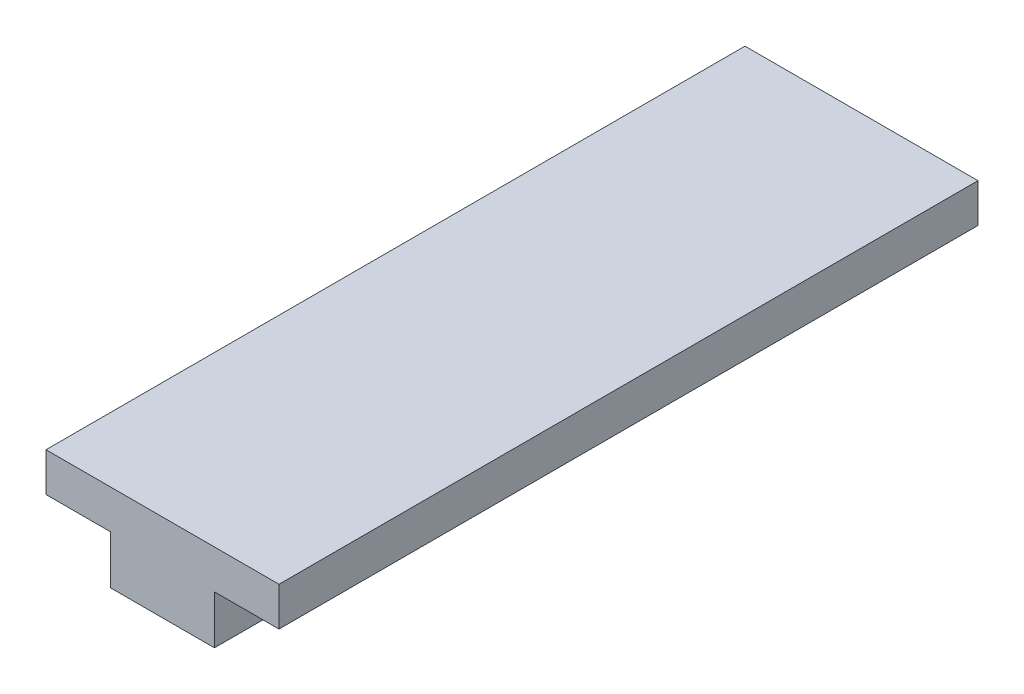
ISO-10303-21;
HEADER;
FILE_DESCRIPTION(('STEP AP214'),'2;1');
FILE_NAME('part.step','',(''),(''),'','','');
FILE_SCHEMA(('AUTOMOTIVE_DESIGN { 1 0 10303 214 1 1 1 1 }'));
ENDSEC;
DATA;
#1=APPLICATION_CONTEXT('core data for automotive mechanical design processes');
#2=APPLICATION_PROTOCOL_DEFINITION('international standard','automotive_design',2000,#1);
#3=PRODUCT_CONTEXT('',#1,'mechanical');
#4=PRODUCT('Part','Part','',(#3));
#5=PRODUCT_RELATED_PRODUCT_CATEGORY('part','',(#4));
#6=PRODUCT_DEFINITION_FORMATION('','',#4);
#7=PRODUCT_DEFINITION_CONTEXT('part definition',#1,'design');
#8=PRODUCT_DEFINITION('design','',#6,#7);
#9=PRODUCT_DEFINITION_SHAPE('','',#8);
#10=(LENGTH_UNIT() NAMED_UNIT(*) SI_UNIT(.MILLI.,.METRE.));
#11=(NAMED_UNIT(*) PLANE_ANGLE_UNIT() SI_UNIT($,.RADIAN.));
#12=(NAMED_UNIT(*) SI_UNIT($,.STERADIAN.) SOLID_ANGLE_UNIT());
#13=UNCERTAINTY_MEASURE_WITH_UNIT(LENGTH_MEASURE(1.E-05),#10,'distance_accuracy_value','');
#14=(GEOMETRIC_REPRESENTATION_CONTEXT(3) GLOBAL_UNCERTAINTY_ASSIGNED_CONTEXT((#13)) GLOBAL_UNIT_ASSIGNED_CONTEXT((#10,
#11,#12)) REPRESENTATION_CONTEXT('',''));
#15=CARTESIAN_POINT('',(0.,0.,0.));
#16=DIRECTION('',(0.,0.,1.));
#17=DIRECTION('',(1.,0.,0.));
#18=AXIS2_PLACEMENT_3D('',#15,#16,#17);
#19=CARTESIAN_POINT('',(12.,0.,0.));
#20=DIRECTION('',(0.,1.,0.));
#21=DIRECTION('',(0.,0.,1.));
#22=AXIS2_PLACEMENT_3D('',#19,#20,#21);
#23=PLANE('',#22);
#24=DIRECTION('',(0.,0.,-1.));
#25=VECTOR('',#24,1.);
#26=CARTESIAN_POINT('',(-5.35,0.,0.));
#27=LINE('',#26,#25);
#28=CARTESIAN_POINT('',(-5.35,0.,0.));
#29=VERTEX_POINT('',#28);
#30=CARTESIAN_POINT('',(-5.35000000000002,0.,-44.65));
#31=VERTEX_POINT('',#30);
#32=EDGE_CURVE('E132',#29,#31,#27,.T.);
#33=ORIENTED_EDGE('',*,*,#32,.F.);
#34=DIRECTION('',(-1.,0.,0.));
#35=VECTOR('',#34,1.);
#36=CARTESIAN_POINT('',(12.,0.,0.));
#37=LINE('',#36,#35);
#38=CARTESIAN_POINT('',(-12.,0.,0.));
#39=VERTEX_POINT('',#38);
#40=EDGE_CURVE('E88',#29,#39,#37,.T.);
#41=ORIENTED_EDGE('',*,*,#40,.T.);
#42=DIRECTION('',(0.,0.,-1.));
#43=VECTOR('',#42,1.);
#44=CARTESIAN_POINT('',(-12.,0.,0.));
#45=LINE('',#44,#43);
#46=CARTESIAN_POINT('',(-12.,0.,-72.));
#47=VERTEX_POINT('',#46);
#48=EDGE_CURVE('E157',#39,#47,#45,.T.);
#49=ORIENTED_EDGE('',*,*,#48,.T.);
#50=DIRECTION('',(-1.,0.,0.));
#51=VECTOR('',#50,1.);
#52=CARTESIAN_POINT('',(12.,0.,-72.));
#53=LINE('',#52,#51);
#54=CARTESIAN_POINT('',(12.,0.,-72.));
#55=VERTEX_POINT('',#54);
#56=EDGE_CURVE('E11',#55,#47,#53,.T.);
#57=ORIENTED_EDGE('',*,*,#56,.F.);
#58=DIRECTION('',(0.,0.,-1.));
#59=VECTOR('',#58,1.);
#60=CARTESIAN_POINT('',(12.,0.,0.));
#61=LINE('',#60,#59);
#62=CARTESIAN_POINT('',(12.,0.,0.));
#63=VERTEX_POINT('',#62);
#64=EDGE_CURVE('E163',#63,#55,#61,.T.);
#65=ORIENTED_EDGE('',*,*,#64,.F.);
#66=CARTESIAN_POINT('',(5.35,0.,0.));
#67=VERTEX_POINT('',#66);
#68=EDGE_CURVE('E65',#63,#67,#37,.T.);
#69=ORIENTED_EDGE('',*,*,#68,.T.);
#70=DIRECTION('',(0.,0.,-1.));
#71=VECTOR('',#70,1.);
#72=CARTESIAN_POINT('',(5.35,0.,0.));
#73=LINE('',#72,#71);
#74=CARTESIAN_POINT('',(5.35,0.,-44.65));
#75=VERTEX_POINT('',#74);
#76=EDGE_CURVE('E141',#67,#75,#73,.T.);
#77=ORIENTED_EDGE('',*,*,#76,.T.);
#78=CARTESIAN_POINT('',(0.,0.,-44.65));
#79=DIRECTION('',(0.,1.,0.));
#80=DIRECTION('',(0.,0.,1.));
#81=AXIS2_PLACEMENT_3D('',#78,#79,#80);
#82=CIRCLE('',#81,5.35000000000001);
#83=EDGE_CURVE('E56',#31,#75,#82,.F.);
#84=ORIENTED_EDGE('',*,*,#83,.F.);
#85=EDGE_LOOP('',(#33,#41,#49,#57,#65,#69,#77,#84));
#86=FACE_BOUND('',#85,.T.);
#87=ADVANCED_FACE('F41',(#86),#23,.F.);
#88=CARTESIAN_POINT('',(12.,0.,-72.));
#89=DIRECTION('',(0.,0.,1.));
#90=DIRECTION('',(1.,0.,0.));
#91=AXIS2_PLACEMENT_3D('',#88,#89,#90);
#92=PLANE('',#91);
#93=DIRECTION('',(0.,1.,0.));
#94=VECTOR('',#93,1.);
#95=CARTESIAN_POINT('',(-12.,0.,-72.));
#96=LINE('',#95,#94);
#97=CARTESIAN_POINT('',(-12.,3.99999999999999,-72.));
#98=VERTEX_POINT('',#97);
#99=EDGE_CURVE('E178',#47,#98,#96,.T.);
#100=ORIENTED_EDGE('',*,*,#99,.T.);
#101=DIRECTION('',(-1.,0.,0.));
#102=VECTOR('',#101,1.);
#103=CARTESIAN_POINT('',(12.,3.99999999999999,-72.));
#104=LINE('',#103,#102);
#105=CARTESIAN_POINT('',(12.,3.99999999999999,-72.));
#106=VERTEX_POINT('',#105);
#107=EDGE_CURVE('E49',#106,#98,#104,.T.);
#108=ORIENTED_EDGE('',*,*,#107,.F.);
#109=DIRECTION('',(0.,1.,0.));
#110=VECTOR('',#109,1.);
#111=CARTESIAN_POINT('',(12.,0.,-72.));
#112=LINE('',#111,#110);
#113=EDGE_CURVE('E95',#55,#106,#112,.T.);
#114=ORIENTED_EDGE('',*,*,#113,.F.);
#115=ORIENTED_EDGE('',*,*,#56,.T.);
#116=EDGE_LOOP('',(#100,#108,#114,#115));
#117=FACE_BOUND('',#116,.T.);
#118=ADVANCED_FACE('F198',(#117),#92,.F.);
#119=CARTESIAN_POINT('',(12.,3.99999999999999,0.));
#120=DIRECTION('',(0.,1.,0.));
#121=DIRECTION('',(0.,0.,1.));
#122=AXIS2_PLACEMENT_3D('',#119,#120,#121);
#123=PLANE('',#122);
#124=DIRECTION('',(0.,0.,-1.));
#125=VECTOR('',#124,1.);
#126=CARTESIAN_POINT('',(-12.,3.99999999999999,0.));
#127=LINE('',#126,#125);
#128=CARTESIAN_POINT('',(-12.,3.99999999999999,0.));
#129=VERTEX_POINT('',#128);
#130=EDGE_CURVE('E182',#129,#98,#127,.T.);
#131=ORIENTED_EDGE('',*,*,#130,.F.);
#132=DIRECTION('',(-1.,0.,0.));
#133=VECTOR('',#132,1.);
#134=CARTESIAN_POINT('',(12.,3.99999999999999,0.));
#135=LINE('',#134,#133);
#136=CARTESIAN_POINT('',(12.,3.99999999999999,0.));
#137=VERTEX_POINT('',#136);
#138=EDGE_CURVE('E191',#137,#129,#135,.T.);
#139=ORIENTED_EDGE('',*,*,#138,.F.);
#140=DIRECTION('',(0.,0.,-1.));
#141=VECTOR('',#140,1.);
#142=CARTESIAN_POINT('',(12.,3.99999999999999,0.));
#143=LINE('',#142,#141);
#144=EDGE_CURVE('E169',#137,#106,#143,.T.);
#145=ORIENTED_EDGE('',*,*,#144,.T.);
#146=ORIENTED_EDGE('',*,*,#107,.T.);
#147=EDGE_LOOP('',(#131,#139,#145,#146));
#148=FACE_BOUND('',#147,.T.);
#149=ADVANCED_FACE('F196',(#148),#123,.T.);
#150=CARTESIAN_POINT('',(12.,0.,0.));
#151=DIRECTION('',(0.,0.,1.));
#152=DIRECTION('',(1.,0.,0.));
#153=AXIS2_PLACEMENT_3D('',#150,#151,#152);
#154=PLANE('',#153);
#155=DIRECTION('',(0.,1.,0.));
#156=VECTOR('',#155,1.);
#157=CARTESIAN_POINT('',(-12.,0.,0.));
#158=LINE('',#157,#156);
#159=EDGE_CURVE('E166',#39,#129,#158,.T.);
#160=ORIENTED_EDGE('',*,*,#159,.F.);
#161=ORIENTED_EDGE('',*,*,#40,.F.);
#162=DIRECTION('',(0.,1.,0.));
#163=VECTOR('',#162,1.);
#164=CARTESIAN_POINT('',(-5.35,-5.,0.));
#165=LINE('',#164,#163);
#166=CARTESIAN_POINT('',(-5.35,-5.,0.));
#167=VERTEX_POINT('',#166);
#168=EDGE_CURVE('E134',#167,#29,#165,.T.);
#169=ORIENTED_EDGE('',*,*,#168,.F.);
#170=DIRECTION('',(1.,0.,0.));
#171=VECTOR('',#170,1.);
#172=CARTESIAN_POINT('',(0.,-5.,0.));
#173=LINE('',#172,#171);
#174=CARTESIAN_POINT('',(5.35,-5.,0.));
#175=VERTEX_POINT('',#174);
#176=EDGE_CURVE('E126',#167,#175,#173,.T.);
#177=ORIENTED_EDGE('',*,*,#176,.T.);
#178=DIRECTION('',(0.,1.,0.));
#179=VECTOR('',#178,1.);
#180=CARTESIAN_POINT('',(5.35,-5.,0.));
#181=LINE('',#180,#179);
#182=EDGE_CURVE('E158',#175,#67,#181,.T.);
#183=ORIENTED_EDGE('',*,*,#182,.T.);
#184=ORIENTED_EDGE('',*,*,#68,.F.);
#185=DIRECTION('',(0.,1.,0.));
#186=VECTOR('',#185,1.);
#187=CARTESIAN_POINT('',(12.,0.,0.));
#188=LINE('',#187,#186);
#189=EDGE_CURVE('E173',#63,#137,#188,.T.);
#190=ORIENTED_EDGE('',*,*,#189,.T.);
#191=ORIENTED_EDGE('',*,*,#138,.T.);
#192=EDGE_LOOP('',(#160,#161,#169,#177,#183,#184,#190,#191));
#193=FACE_BOUND('',#192,.T.);
#194=ADVANCED_FACE('F203',(#193),#154,.T.);
#195=CARTESIAN_POINT('',(12.,0.,0.));
#196=DIRECTION('',(1.,0.,0.));
#197=DIRECTION('',(0.,0.,-1.));
#198=AXIS2_PLACEMENT_3D('',#195,#196,#197);
#199=PLANE('',#198);
#200=ORIENTED_EDGE('',*,*,#64,.T.);
#201=ORIENTED_EDGE('',*,*,#113,.T.);
#202=ORIENTED_EDGE('',*,*,#144,.F.);
#203=ORIENTED_EDGE('',*,*,#189,.F.);
#204=EDGE_LOOP('',(#200,#201,#202,#203));
#205=FACE_BOUND('',#204,.T.);
#206=ADVANCED_FACE('F206',(#205),#199,.T.);
#207=CARTESIAN_POINT('',(-12.,0.,0.));
#208=DIRECTION('',(1.,0.,0.));
#209=DIRECTION('',(0.,0.,-1.));
#210=AXIS2_PLACEMENT_3D('',#207,#208,#209);
#211=PLANE('',#210);
#212=ORIENTED_EDGE('',*,*,#48,.F.);
#213=ORIENTED_EDGE('',*,*,#159,.T.);
#214=ORIENTED_EDGE('',*,*,#130,.T.);
#215=ORIENTED_EDGE('',*,*,#99,.F.);
#216=EDGE_LOOP('',(#212,#213,#214,#215));
#217=FACE_BOUND('',#216,.T.);
#218=ADVANCED_FACE('F201',(#217),#211,.F.);
#219=CARTESIAN_POINT('',(0.,-5.,-44.65));
#220=DIRECTION('',(0.,1.,0.));
#221=DIRECTION('',(0.,0.,1.));
#222=AXIS2_PLACEMENT_3D('',#219,#220,#221);
#223=CYLINDRICAL_SURFACE('',#222,5.35000000000001);
#224=ORIENTED_EDGE('',*,*,#83,.T.);
#225=DIRECTION('',(0.,1.,0.));
#226=VECTOR('',#225,1.);
#227=CARTESIAN_POINT('',(5.35,-5.,-44.65));
#228=LINE('',#227,#226);
#229=CARTESIAN_POINT('',(5.35,-5.,-44.65));
#230=VERTEX_POINT('',#229);
#231=EDGE_CURVE('E138',#230,#75,#228,.T.);
#232=ORIENTED_EDGE('',*,*,#231,.F.);
#233=CARTESIAN_POINT('',(0.,-5.,-44.65));
#234=DIRECTION('',(0.,1.,0.));
#235=DIRECTION('',(0.,0.,1.));
#236=AXIS2_PLACEMENT_3D('',#233,#234,#235);
#237=CIRCLE('',#236,5.35000000000001);
#238=CARTESIAN_POINT('',(-5.35000000000002,-5.,-44.65));
#239=VERTEX_POINT('',#238);
#240=EDGE_CURVE('E124',#239,#230,#237,.F.);
#241=ORIENTED_EDGE('',*,*,#240,.F.);
#242=DIRECTION('',(0.,1.,0.));
#243=VECTOR('',#242,1.);
#244=CARTESIAN_POINT('',(-5.35000000000002,-5.,-44.65));
#245=LINE('',#244,#243);
#246=EDGE_CURVE('E130',#239,#31,#245,.T.);
#247=ORIENTED_EDGE('',*,*,#246,.T.);
#248=EDGE_LOOP('',(#224,#232,#241,#247));
#249=FACE_BOUND('',#248,.T.);
#250=ADVANCED_FACE('F137',(#249),#223,.T.);
#251=CARTESIAN_POINT('',(5.35,-5.,0.));
#252=DIRECTION('',(1.,0.,0.));
#253=DIRECTION('',(0.,0.,-1.));
#254=AXIS2_PLACEMENT_3D('',#251,#252,#253);
#255=PLANE('',#254);
#256=ORIENTED_EDGE('',*,*,#76,.F.);
#257=ORIENTED_EDGE('',*,*,#182,.F.);
#258=DIRECTION('',(0.,0.,-1.));
#259=VECTOR('',#258,1.);
#260=CARTESIAN_POINT('',(5.35,-5.,0.));
#261=LINE('',#260,#259);
#262=EDGE_CURVE('E135',#175,#230,#261,.T.);
#263=ORIENTED_EDGE('',*,*,#262,.T.);
#264=ORIENTED_EDGE('',*,*,#231,.T.);
#265=EDGE_LOOP('',(#256,#257,#263,#264));
#266=FACE_BOUND('',#265,.T.);
#267=ADVANCED_FACE('F224',(#266),#255,.T.);
#268=CARTESIAN_POINT('',(-5.35,-5.,0.));
#269=DIRECTION('',(1.,0.,0.));
#270=DIRECTION('',(0.,0.,-1.));
#271=AXIS2_PLACEMENT_3D('',#268,#269,#270);
#272=PLANE('',#271);
#273=ORIENTED_EDGE('',*,*,#32,.T.);
#274=ORIENTED_EDGE('',*,*,#246,.F.);
#275=DIRECTION('',(0.,0.,-1.));
#276=VECTOR('',#275,1.);
#277=CARTESIAN_POINT('',(-5.35,-5.,0.));
#278=LINE('',#277,#276);
#279=EDGE_CURVE('E119',#167,#239,#278,.T.);
#280=ORIENTED_EDGE('',*,*,#279,.F.);
#281=ORIENTED_EDGE('',*,*,#168,.T.);
#282=EDGE_LOOP('',(#273,#274,#280,#281));
#283=FACE_BOUND('',#282,.T.);
#284=ADVANCED_FACE('F131',(#283),#272,.F.);
#285=CARTESIAN_POINT('',(0.,-5.,0.));
#286=DIRECTION('',(0.,1.,0.));
#287=DIRECTION('',(0.,0.,1.));
#288=AXIS2_PLACEMENT_3D('',#285,#286,#287);
#289=PLANE('',#288);
#290=ORIENTED_EDGE('',*,*,#240,.T.);
#291=ORIENTED_EDGE('',*,*,#262,.F.);
#292=ORIENTED_EDGE('',*,*,#176,.F.);
#293=ORIENTED_EDGE('',*,*,#279,.T.);
#294=EDGE_LOOP('',(#290,#291,#292,#293));
#295=FACE_BOUND('',#294,.T.);
#296=ADVANCED_FACE('F121',(#295),#289,.F.);
#297=CLOSED_SHELL('',(#87,#118,#149,#194,#206,#218,#250,#267,#284,#296));
#298=MANIFOLD_SOLID_BREP('B2',#297);
#299=ADVANCED_BREP_SHAPE_REPRESENTATION('',(#18,#298),#14);
#300=SHAPE_DEFINITION_REPRESENTATION(#9,#299);
ENDSEC;
END-ISO-10303-21;
